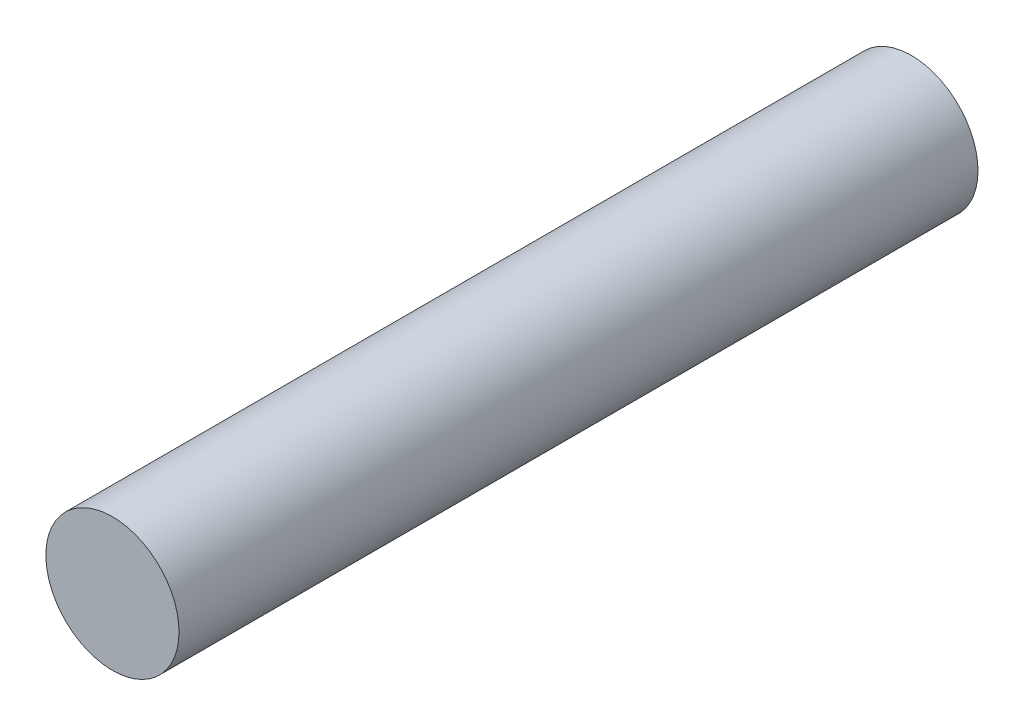
ISO-10303-21;
HEADER;
FILE_DESCRIPTION(('STEP AP214'),'2;1');
FILE_NAME('part.step','',(''),(''),'','','');
FILE_SCHEMA(('AUTOMOTIVE_DESIGN { 1 0 10303 214 1 1 1 1 }'));
ENDSEC;
DATA;
#1=APPLICATION_CONTEXT('core data for automotive mechanical design processes');
#2=APPLICATION_PROTOCOL_DEFINITION('international standard','automotive_design',2000,#1);
#3=PRODUCT_CONTEXT('',#1,'mechanical');
#4=PRODUCT('Part','Part','',(#3));
#5=PRODUCT_RELATED_PRODUCT_CATEGORY('part','',(#4));
#6=PRODUCT_DEFINITION_FORMATION('','',#4);
#7=PRODUCT_DEFINITION_CONTEXT('part definition',#1,'design');
#8=PRODUCT_DEFINITION('design','',#6,#7);
#9=PRODUCT_DEFINITION_SHAPE('','',#8);
#10=(LENGTH_UNIT() NAMED_UNIT(*) SI_UNIT(.MILLI.,.METRE.));
#11=(NAMED_UNIT(*) PLANE_ANGLE_UNIT() SI_UNIT($,.RADIAN.));
#12=(NAMED_UNIT(*) SI_UNIT($,.STERADIAN.) SOLID_ANGLE_UNIT());
#13=UNCERTAINTY_MEASURE_WITH_UNIT(LENGTH_MEASURE(1.E-05),#10,'distance_accuracy_value','');
#14=(GEOMETRIC_REPRESENTATION_CONTEXT(3) GLOBAL_UNCERTAINTY_ASSIGNED_CONTEXT((#13)) GLOBAL_UNIT_ASSIGNED_CONTEXT((#10,
#11,#12)) REPRESENTATION_CONTEXT('',''));
#15=CARTESIAN_POINT('',(0.,0.,0.));
#16=DIRECTION('',(0.,0.,1.));
#17=DIRECTION('',(1.,0.,0.));
#18=AXIS2_PLACEMENT_3D('',#15,#16,#17);
#19=CARTESIAN_POINT('',(-19.,30.4286384577808,-15.));
#20=DIRECTION('',(0.,0.,1.));
#21=DIRECTION('',(1.,0.,0.));
#22=AXIS2_PLACEMENT_3D('',#19,#20,#21);
#23=CYLINDRICAL_SURFACE('',#22,2.5);
#24=CARTESIAN_POINT('',(-19.,30.4286384577808,-15.));
#25=DIRECTION('',(0.,0.,1.));
#26=DIRECTION('',(1.,0.,0.));
#27=AXIS2_PLACEMENT_3D('',#24,#25,#26);
#28=CIRCLE('',#27,2.5);
#29=CARTESIAN_POINT('',(-16.5,30.4286384577808,-15.));
#30=VERTEX_POINT('',#29);
#31=EDGE_CURVE('E10',#30,#30,#28,.T.);
#32=ORIENTED_EDGE('',*,*,#31,.T.);
#33=EDGE_LOOP('',(#32));
#34=FACE_BOUND('',#33,.T.);
#35=CARTESIAN_POINT('',(-19.,30.4286384577808,15.));
#36=DIRECTION('',(0.,0.,1.));
#37=DIRECTION('',(1.,0.,0.));
#38=AXIS2_PLACEMENT_3D('',#35,#36,#37);
#39=CIRCLE('',#38,2.5);
#40=CARTESIAN_POINT('',(-16.5,30.4286384577808,15.));
#41=VERTEX_POINT('',#40);
#42=EDGE_CURVE('E44',#41,#41,#39,.T.);
#43=ORIENTED_EDGE('',*,*,#42,.F.);
#44=EDGE_LOOP('',(#43));
#45=FACE_BOUND('',#44,.T.);
#46=ADVANCED_FACE('F41',(#34,#45),#23,.T.);
#47=CARTESIAN_POINT('',(-19.,30.4286384577808,-15.));
#48=DIRECTION('',(0.,0.,1.));
#49=DIRECTION('',(1.,0.,0.));
#50=AXIS2_PLACEMENT_3D('',#47,#48,#49);
#51=PLANE('',#50);
#52=ORIENTED_EDGE('',*,*,#31,.F.);
#53=EDGE_LOOP('',(#52));
#54=FACE_BOUND('',#53,.T.);
#55=ADVANCED_FACE('F58',(#54),#51,.F.);
#56=CARTESIAN_POINT('',(-19.,30.4286384577808,15.));
#57=DIRECTION('',(0.,0.,1.));
#58=DIRECTION('',(1.,0.,0.));
#59=AXIS2_PLACEMENT_3D('',#56,#57,#58);
#60=PLANE('',#59);
#61=ORIENTED_EDGE('',*,*,#42,.T.);
#62=EDGE_LOOP('',(#61));
#63=FACE_BOUND('',#62,.T.);
#64=ADVANCED_FACE('F55',(#63),#60,.T.);
#65=CLOSED_SHELL('',(#46,#55,#64));
#66=MANIFOLD_SOLID_BREP('B2',#65);
#67=ADVANCED_BREP_SHAPE_REPRESENTATION('',(#18,#66),#14);
#68=SHAPE_DEFINITION_REPRESENTATION(#9,#67);
ENDSEC;
END-ISO-10303-21;
